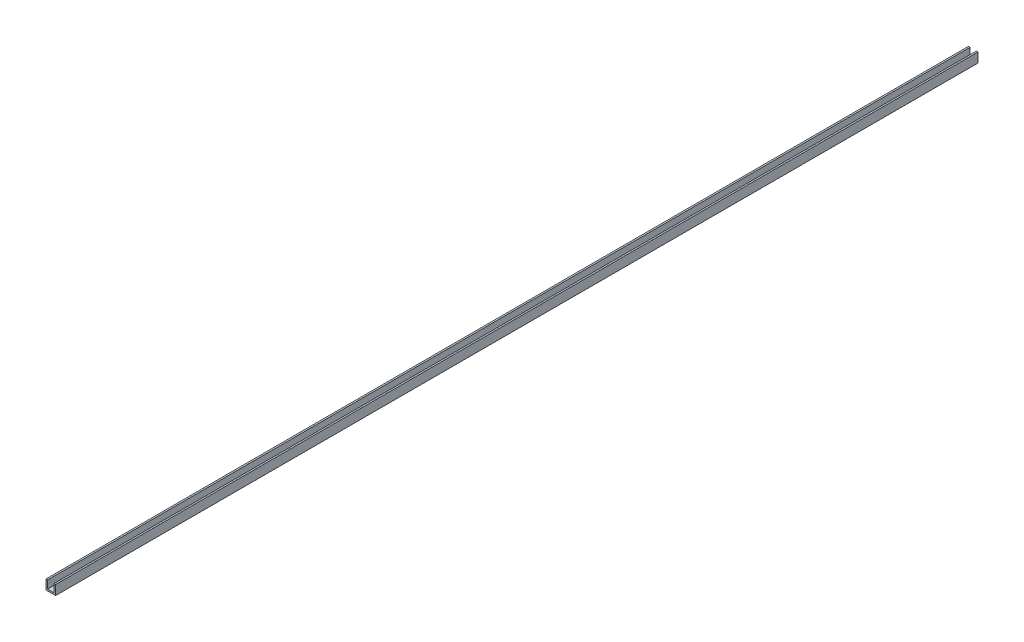
ISO-10303-21;
HEADER;
FILE_DESCRIPTION(('STEP AP214'),'2;1');
FILE_NAME('part.step','',(''),(''),'','','');
FILE_SCHEMA(('AUTOMOTIVE_DESIGN { 1 0 10303 214 1 1 1 1 }'));
ENDSEC;
DATA;
#1=APPLICATION_CONTEXT('core data for automotive mechanical design processes');
#2=APPLICATION_PROTOCOL_DEFINITION('international standard','automotive_design',2000,#1);
#3=PRODUCT_CONTEXT('',#1,'mechanical');
#4=PRODUCT('Part','Part','',(#3));
#5=PRODUCT_RELATED_PRODUCT_CATEGORY('part','',(#4));
#6=PRODUCT_DEFINITION_FORMATION('','',#4);
#7=PRODUCT_DEFINITION_CONTEXT('part definition',#1,'design');
#8=PRODUCT_DEFINITION('design','',#6,#7);
#9=PRODUCT_DEFINITION_SHAPE('','',#8);
#10=(LENGTH_UNIT() NAMED_UNIT(*) SI_UNIT(.MILLI.,.METRE.));
#11=(NAMED_UNIT(*) PLANE_ANGLE_UNIT() SI_UNIT($,.RADIAN.));
#12=(NAMED_UNIT(*) SI_UNIT($,.STERADIAN.) SOLID_ANGLE_UNIT());
#13=UNCERTAINTY_MEASURE_WITH_UNIT(LENGTH_MEASURE(1.E-05),#10,'distance_accuracy_value','');
#14=(GEOMETRIC_REPRESENTATION_CONTEXT(3) GLOBAL_UNCERTAINTY_ASSIGNED_CONTEXT((#13)) GLOBAL_UNIT_ASSIGNED_CONTEXT((#10,
#11,#12)) REPRESENTATION_CONTEXT('',''));
#15=CARTESIAN_POINT('',(0.,0.,0.));
#16=DIRECTION('',(0.,0.,1.));
#17=DIRECTION('',(1.,0.,0.));
#18=AXIS2_PLACEMENT_3D('',#15,#16,#17);
#19=CARTESIAN_POINT('',(3.175,0.,1828.8));
#20=DIRECTION('',(0.,-1.,0.));
#21=DIRECTION('',(0.,0.,-1.));
#22=AXIS2_PLACEMENT_3D('',#19,#20,#21);
#23=PLANE('',#22);
#24=DIRECTION('',(-1.,0.,0.));
#25=VECTOR('',#24,1.);
#26=CARTESIAN_POINT('',(3.175,0.,0.));
#27=LINE('',#26,#25);
#28=CARTESIAN_POINT('',(3.175,0.,0.));
#29=VERTEX_POINT('',#28);
#30=CARTESIAN_POINT('',(0.,0.,0.));
#31=VERTEX_POINT('',#30);
#32=EDGE_CURVE('E130',#29,#31,#27,.T.);
#33=ORIENTED_EDGE('',*,*,#32,.T.);
#34=DIRECTION('',(0.,0.,-1.));
#35=VECTOR('',#34,1.);
#36=CARTESIAN_POINT('',(0.,0.,1828.8));
#37=LINE('',#36,#35);
#38=CARTESIAN_POINT('',(0.,0.,1828.8));
#39=VERTEX_POINT('',#38);
#40=EDGE_CURVE('E11',#39,#31,#37,.T.);
#41=ORIENTED_EDGE('',*,*,#40,.F.);
#42=DIRECTION('',(-1.,0.,0.));
#43=VECTOR('',#42,1.);
#44=CARTESIAN_POINT('',(3.175,0.,1828.8));
#45=LINE('',#44,#43);
#46=CARTESIAN_POINT('',(3.175,0.,1828.8));
#47=VERTEX_POINT('',#46);
#48=EDGE_CURVE('E144',#47,#39,#45,.T.);
#49=ORIENTED_EDGE('',*,*,#48,.F.);
#50=DIRECTION('',(0.,0.,-1.));
#51=VECTOR('',#50,1.);
#52=CARTESIAN_POINT('',(3.175,0.,1828.8));
#53=LINE('',#52,#51);
#54=EDGE_CURVE('E126',#47,#29,#53,.T.);
#55=ORIENTED_EDGE('',*,*,#54,.T.);
#56=EDGE_LOOP('',(#33,#41,#49,#55));
#57=FACE_BOUND('',#56,.T.);
#58=ADVANCED_FACE('F34',(#57),#23,.F.);
#59=CARTESIAN_POINT('',(0.,0.,1828.8));
#60=DIRECTION('',(1.,0.,0.));
#61=DIRECTION('',(0.,1.,0.));
#62=AXIS2_PLACEMENT_3D('',#59,#60,#61);
#63=PLANE('',#62);
#64=DIRECTION('',(0.,-1.,0.));
#65=VECTOR('',#64,1.);
#66=CARTESIAN_POINT('',(0.,0.,0.));
#67=LINE('',#66,#65);
#68=CARTESIAN_POINT('',(0.,-19.05,0.));
#69=VERTEX_POINT('',#68);
#70=EDGE_CURVE('E133',#31,#69,#67,.T.);
#71=ORIENTED_EDGE('',*,*,#70,.T.);
#72=DIRECTION('',(0.,0.,-1.));
#73=VECTOR('',#72,1.);
#74=CARTESIAN_POINT('',(0.,-19.05,1828.8));
#75=LINE('',#74,#73);
#76=CARTESIAN_POINT('',(0.,-19.05,1828.8));
#77=VERTEX_POINT('',#76);
#78=EDGE_CURVE('E42',#77,#69,#75,.T.);
#79=ORIENTED_EDGE('',*,*,#78,.F.);
#80=DIRECTION('',(0.,-1.,0.));
#81=VECTOR('',#80,1.);
#82=CARTESIAN_POINT('',(0.,0.,1828.8));
#83=LINE('',#82,#81);
#84=EDGE_CURVE('E93',#39,#77,#83,.T.);
#85=ORIENTED_EDGE('',*,*,#84,.F.);
#86=ORIENTED_EDGE('',*,*,#40,.T.);
#87=EDGE_LOOP('',(#71,#79,#85,#86));
#88=FACE_BOUND('',#87,.T.);
#89=ADVANCED_FACE('F179',(#88),#63,.F.);
#90=CARTESIAN_POINT('',(0.,-19.05,1828.8));
#91=DIRECTION('',(0.,1.,0.));
#92=DIRECTION('',(0.,0.,1.));
#93=AXIS2_PLACEMENT_3D('',#90,#91,#92);
#94=PLANE('',#93);
#95=DIRECTION('',(1.,0.,0.));
#96=VECTOR('',#95,1.);
#97=CARTESIAN_POINT('',(0.,-19.05,0.));
#98=LINE('',#97,#96);
#99=CARTESIAN_POINT('',(19.05,-19.05,0.));
#100=VERTEX_POINT('',#99);
#101=EDGE_CURVE('E135',#69,#100,#98,.T.);
#102=ORIENTED_EDGE('',*,*,#101,.T.);
#103=DIRECTION('',(0.,0.,-1.));
#104=VECTOR('',#103,1.);
#105=CARTESIAN_POINT('',(19.05,-19.05,1828.8));
#106=LINE('',#105,#104);
#107=CARTESIAN_POINT('',(19.05,-19.05,1828.8));
#108=VERTEX_POINT('',#107);
#109=EDGE_CURVE('E151',#108,#100,#106,.T.);
#110=ORIENTED_EDGE('',*,*,#109,.F.);
#111=DIRECTION('',(1.,0.,0.));
#112=VECTOR('',#111,1.);
#113=CARTESIAN_POINT('',(0.,-19.05,1828.8));
#114=LINE('',#113,#112);
#115=EDGE_CURVE('E159',#77,#108,#114,.T.);
#116=ORIENTED_EDGE('',*,*,#115,.F.);
#117=ORIENTED_EDGE('',*,*,#78,.T.);
#118=EDGE_LOOP('',(#102,#110,#116,#117));
#119=FACE_BOUND('',#118,.T.);
#120=ADVANCED_FACE('F157',(#119),#94,.F.);
#121=CARTESIAN_POINT('',(19.05,-19.05,1828.8));
#122=DIRECTION('',(-1.,0.,0.));
#123=DIRECTION('',(0.,0.,1.));
#124=AXIS2_PLACEMENT_3D('',#121,#122,#123);
#125=PLANE('',#124);
#126=DIRECTION('',(0.,1.,0.));
#127=VECTOR('',#126,1.);
#128=CARTESIAN_POINT('',(19.05,-19.05,0.));
#129=LINE('',#128,#127);
#130=CARTESIAN_POINT('',(19.05,0.,0.));
#131=VERTEX_POINT('',#130);
#132=EDGE_CURVE('E137',#100,#131,#129,.T.);
#133=ORIENTED_EDGE('',*,*,#132,.T.);
#134=DIRECTION('',(0.,0.,-1.));
#135=VECTOR('',#134,1.);
#136=CARTESIAN_POINT('',(19.05,0.,1828.8));
#137=LINE('',#136,#135);
#138=CARTESIAN_POINT('',(19.05,0.,1828.8));
#139=VERTEX_POINT('',#138);
#140=EDGE_CURVE('E148',#139,#131,#137,.T.);
#141=ORIENTED_EDGE('',*,*,#140,.F.);
#142=DIRECTION('',(0.,1.,0.));
#143=VECTOR('',#142,1.);
#144=CARTESIAN_POINT('',(19.05,-19.05,1828.8));
#145=LINE('',#144,#143);
#146=EDGE_CURVE('E171',#108,#139,#145,.T.);
#147=ORIENTED_EDGE('',*,*,#146,.F.);
#148=ORIENTED_EDGE('',*,*,#109,.T.);
#149=EDGE_LOOP('',(#133,#141,#147,#148));
#150=FACE_BOUND('',#149,.T.);
#151=ADVANCED_FACE('F167',(#150),#125,.F.);
#152=CARTESIAN_POINT('',(19.05,0.,1828.8));
#153=DIRECTION('',(0.,-1.,0.));
#154=DIRECTION('',(1.,0.,0.));
#155=AXIS2_PLACEMENT_3D('',#152,#153,#154);
#156=PLANE('',#155);
#157=DIRECTION('',(-1.,0.,0.));
#158=VECTOR('',#157,1.);
#159=CARTESIAN_POINT('',(19.05,0.,0.));
#160=LINE('',#159,#158);
#161=CARTESIAN_POINT('',(15.875,0.,0.));
#162=VERTEX_POINT('',#161);
#163=EDGE_CURVE('E139',#131,#162,#160,.T.);
#164=ORIENTED_EDGE('',*,*,#163,.T.);
#165=DIRECTION('',(0.,0.,-1.));
#166=VECTOR('',#165,1.);
#167=CARTESIAN_POINT('',(15.875,0.,1828.8));
#168=LINE('',#167,#166);
#169=CARTESIAN_POINT('',(15.875,0.,1828.8));
#170=VERTEX_POINT('',#169);
#171=EDGE_CURVE('E121',#170,#162,#168,.T.);
#172=ORIENTED_EDGE('',*,*,#171,.F.);
#173=DIRECTION('',(-1.,0.,0.));
#174=VECTOR('',#173,1.);
#175=CARTESIAN_POINT('',(19.05,0.,1828.8));
#176=LINE('',#175,#174);
#177=EDGE_CURVE('E112',#139,#170,#176,.T.);
#178=ORIENTED_EDGE('',*,*,#177,.F.);
#179=ORIENTED_EDGE('',*,*,#140,.T.);
#180=EDGE_LOOP('',(#164,#172,#178,#179));
#181=FACE_BOUND('',#180,.T.);
#182=ADVANCED_FACE('F170',(#181),#156,.F.);
#183=CARTESIAN_POINT('',(15.875,0.,1828.8));
#184=DIRECTION('',(1.,0.,0.));
#185=DIRECTION('',(0.,1.,0.));
#186=AXIS2_PLACEMENT_3D('',#183,#184,#185);
#187=PLANE('',#186);
#188=DIRECTION('',(0.,-1.,0.));
#189=VECTOR('',#188,1.);
#190=CARTESIAN_POINT('',(15.875,0.,0.));
#191=LINE('',#190,#189);
#192=CARTESIAN_POINT('',(15.875,-15.875,0.));
#193=VERTEX_POINT('',#192);
#194=EDGE_CURVE('E120',#162,#193,#191,.T.);
#195=ORIENTED_EDGE('',*,*,#194,.T.);
#196=DIRECTION('',(0.,0.,-1.));
#197=VECTOR('',#196,1.);
#198=CARTESIAN_POINT('',(15.875,-15.875,1828.8));
#199=LINE('',#198,#197);
#200=CARTESIAN_POINT('',(15.875,-15.875,1828.8));
#201=VERTEX_POINT('',#200);
#202=EDGE_CURVE('E117',#201,#193,#199,.T.);
#203=ORIENTED_EDGE('',*,*,#202,.F.);
#204=DIRECTION('',(0.,-1.,0.));
#205=VECTOR('',#204,1.);
#206=CARTESIAN_POINT('',(15.875,0.,1828.8));
#207=LINE('',#206,#205);
#208=EDGE_CURVE('E106',#170,#201,#207,.T.);
#209=ORIENTED_EDGE('',*,*,#208,.F.);
#210=ORIENTED_EDGE('',*,*,#171,.T.);
#211=EDGE_LOOP('',(#195,#203,#209,#210));
#212=FACE_BOUND('',#211,.T.);
#213=ADVANCED_FACE('F118',(#212),#187,.F.);
#214=CARTESIAN_POINT('',(15.875,-15.875,1828.8));
#215=DIRECTION('',(0.,-1.,0.));
#216=DIRECTION('',(0.,0.,-1.));
#217=AXIS2_PLACEMENT_3D('',#214,#215,#216);
#218=PLANE('',#217);
#219=DIRECTION('',(-1.,0.,0.));
#220=VECTOR('',#219,1.);
#221=CARTESIAN_POINT('',(15.875,-15.875,0.));
#222=LINE('',#221,#220);
#223=CARTESIAN_POINT('',(3.175,-15.875,0.));
#224=VERTEX_POINT('',#223);
#225=EDGE_CURVE('E79',#193,#224,#222,.T.);
#226=ORIENTED_EDGE('',*,*,#225,.T.);
#227=DIRECTION('',(0.,0.,-1.));
#228=VECTOR('',#227,1.);
#229=CARTESIAN_POINT('',(3.175,-15.875,1828.8));
#230=LINE('',#229,#228);
#231=CARTESIAN_POINT('',(3.175,-15.875,1828.8));
#232=VERTEX_POINT('',#231);
#233=EDGE_CURVE('E122',#232,#224,#230,.T.);
#234=ORIENTED_EDGE('',*,*,#233,.F.);
#235=DIRECTION('',(-1.,0.,0.));
#236=VECTOR('',#235,1.);
#237=CARTESIAN_POINT('',(15.875,-15.875,1828.8));
#238=LINE('',#237,#236);
#239=EDGE_CURVE('E110',#201,#232,#238,.T.);
#240=ORIENTED_EDGE('',*,*,#239,.F.);
#241=ORIENTED_EDGE('',*,*,#202,.T.);
#242=EDGE_LOOP('',(#226,#234,#240,#241));
#243=FACE_BOUND('',#242,.T.);
#244=ADVANCED_FACE('F124',(#243),#218,.F.);
#245=CARTESIAN_POINT('',(3.175,-15.875,1828.8));
#246=DIRECTION('',(-1.,0.,0.));
#247=DIRECTION('',(0.,0.,1.));
#248=AXIS2_PLACEMENT_3D('',#245,#246,#247);
#249=PLANE('',#248);
#250=DIRECTION('',(0.,1.,0.));
#251=VECTOR('',#250,1.);
#252=CARTESIAN_POINT('',(3.175,-15.875,0.));
#253=LINE('',#252,#251);
#254=EDGE_CURVE('E85',#224,#29,#253,.T.);
#255=ORIENTED_EDGE('',*,*,#254,.T.);
#256=ORIENTED_EDGE('',*,*,#54,.F.);
#257=DIRECTION('',(0.,1.,0.));
#258=VECTOR('',#257,1.);
#259=CARTESIAN_POINT('',(3.175,-15.875,1828.8));
#260=LINE('',#259,#258);
#261=EDGE_CURVE('E50',#232,#47,#260,.T.);
#262=ORIENTED_EDGE('',*,*,#261,.F.);
#263=ORIENTED_EDGE('',*,*,#233,.T.);
#264=EDGE_LOOP('',(#255,#256,#262,#263));
#265=FACE_BOUND('',#264,.T.);
#266=ADVANCED_FACE('F195',(#265),#249,.F.);
#267=CARTESIAN_POINT('',(0.,0.,1828.8));
#268=DIRECTION('',(0.,0.,1.));
#269=DIRECTION('',(1.,0.,0.));
#270=AXIS2_PLACEMENT_3D('',#267,#268,#269);
#271=PLANE('',#270);
#272=ORIENTED_EDGE('',*,*,#48,.T.);
#273=ORIENTED_EDGE('',*,*,#84,.T.);
#274=ORIENTED_EDGE('',*,*,#115,.T.);
#275=ORIENTED_EDGE('',*,*,#146,.T.);
#276=ORIENTED_EDGE('',*,*,#177,.T.);
#277=ORIENTED_EDGE('',*,*,#208,.T.);
#278=ORIENTED_EDGE('',*,*,#239,.T.);
#279=ORIENTED_EDGE('',*,*,#261,.T.);
#280=EDGE_LOOP('',(#272,#273,#274,#275,#276,#277,#278,#279));
#281=FACE_BOUND('',#280,.T.);
#282=ADVANCED_FACE('F108',(#281),#271,.T.);
#283=CARTESIAN_POINT('',(0.,0.,0.));
#284=DIRECTION('',(0.,0.,1.));
#285=DIRECTION('',(1.,0.,0.));
#286=AXIS2_PLACEMENT_3D('',#283,#284,#285);
#287=PLANE('',#286);
#288=ORIENTED_EDGE('',*,*,#32,.F.);
#289=ORIENTED_EDGE('',*,*,#254,.F.);
#290=ORIENTED_EDGE('',*,*,#225,.F.);
#291=ORIENTED_EDGE('',*,*,#194,.F.);
#292=ORIENTED_EDGE('',*,*,#163,.F.);
#293=ORIENTED_EDGE('',*,*,#132,.F.);
#294=ORIENTED_EDGE('',*,*,#101,.F.);
#295=ORIENTED_EDGE('',*,*,#70,.F.);
#296=EDGE_LOOP('',(#288,#289,#290,#291,#292,#293,#294,#295));
#297=FACE_BOUND('',#296,.T.);
#298=ADVANCED_FACE('F163',(#297),#287,.F.);
#299=CLOSED_SHELL('',(#58,#89,#120,#151,#182,#213,#244,#266,#282,#298));
#300=MANIFOLD_SOLID_BREP('B2',#299);
#301=ADVANCED_BREP_SHAPE_REPRESENTATION('',(#18,#300),#14);
#302=SHAPE_DEFINITION_REPRESENTATION(#9,#301);
ENDSEC;
END-ISO-10303-21;
